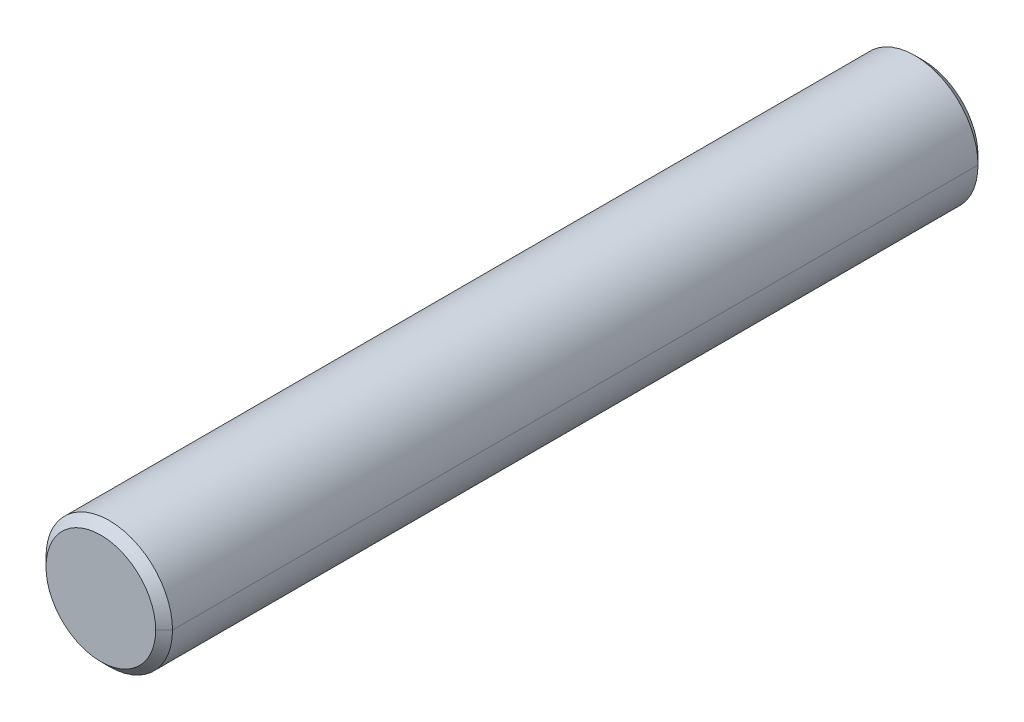
ISO-10303-21;
HEADER;
FILE_DESCRIPTION(('STEP AP214'),'2;1');
FILE_NAME('part.step','',(''),(''),'','','');
FILE_SCHEMA(('AUTOMOTIVE_DESIGN { 1 0 10303 214 1 1 1 1 }'));
ENDSEC;
DATA;
#1=APPLICATION_CONTEXT('core data for automotive mechanical design processes');
#2=APPLICATION_PROTOCOL_DEFINITION('international standard','automotive_design',2000,#1);
#3=PRODUCT_CONTEXT('',#1,'mechanical');
#4=PRODUCT('Part','Part','',(#3));
#5=PRODUCT_RELATED_PRODUCT_CATEGORY('part','',(#4));
#6=PRODUCT_DEFINITION_FORMATION('','',#4);
#7=PRODUCT_DEFINITION_CONTEXT('part definition',#1,'design');
#8=PRODUCT_DEFINITION('design','',#6,#7);
#9=PRODUCT_DEFINITION_SHAPE('','',#8);
#10=(LENGTH_UNIT() NAMED_UNIT(*) SI_UNIT(.MILLI.,.METRE.));
#11=(NAMED_UNIT(*) PLANE_ANGLE_UNIT() SI_UNIT($,.RADIAN.));
#12=(NAMED_UNIT(*) SI_UNIT($,.STERADIAN.) SOLID_ANGLE_UNIT());
#13=UNCERTAINTY_MEASURE_WITH_UNIT(LENGTH_MEASURE(1.E-05),#10,'distance_accuracy_value','');
#14=(GEOMETRIC_REPRESENTATION_CONTEXT(3) GLOBAL_UNCERTAINTY_ASSIGNED_CONTEXT((#13)) GLOBAL_UNIT_ASSIGNED_CONTEXT((#10,
#11,#12)) REPRESENTATION_CONTEXT('',''));
#15=CARTESIAN_POINT('',(0.,0.,0.));
#16=DIRECTION('',(0.,0.,1.));
#17=DIRECTION('',(1.,0.,0.));
#18=AXIS2_PLACEMENT_3D('',#15,#16,#17);
#19=CARTESIAN_POINT('',(0.,0.,-97.5));
#20=DIRECTION('',(0.,0.,1.));
#21=DIRECTION('',(1.,0.,0.));
#22=AXIS2_PLACEMENT_3D('',#19,#20,#21);
#23=PLANE('',#22);
#24=CARTESIAN_POINT('',(0.,0.,-97.5));
#25=DIRECTION('',(0.,0.,-1.));
#26=DIRECTION('',(-1.,0.,0.));
#27=AXIS2_PLACEMENT_3D('',#24,#25,#26);
#28=CIRCLE('',#27,13.);
#29=CARTESIAN_POINT('',(-12.9999999979908,-9.17625102325952E-08,-97.5000000020092));
#30=VERTEX_POINT('',#29);
#31=CARTESIAN_POINT('',(12.9999999979908,9.17625147433775E-08,-97.5000000020092));
#32=VERTEX_POINT('',#31);
#33=EDGE_CURVE('E11',#30,#32,#28,.T.);
#34=ORIENTED_EDGE('',*,*,#33,.T.);
#35=CARTESIAN_POINT('',(0.,0.,-97.5));
#36=DIRECTION('',(0.,0.,-1.));
#37=DIRECTION('',(1.,0.,0.));
#38=AXIS2_PLACEMENT_3D('',#35,#36,#37);
#39=CIRCLE('',#38,13.);
#40=EDGE_CURVE('E26',#32,#30,#39,.T.);
#41=ORIENTED_EDGE('',*,*,#40,.T.);
#42=EDGE_LOOP('',(#34,#41));
#43=FACE_BOUND('',#42,.T.);
#44=ADVANCED_FACE('F16',(#43),#23,.F.);
#45=CARTESIAN_POINT('',(0.,0.,-109.5));
#46=DIRECTION('',(0.,0.,1.));
#47=DIRECTION('',(0.,-1.,0.));
#48=AXIS2_PLACEMENT_3D('',#45,#46,#47);
#49=CONICAL_SURFACE('',#48,1.,0.785398163397448);
#50=DIRECTION('',(-0.707106781186548,-1.49736676786737E-08,0.707106781186548));
#51=VECTOR('',#50,1.);
#52=CARTESIAN_POINT('',(-12.9999999939724,-2.75287530697786E-07,-97.5000000060276));
#53=LINE('',#52,#51);
#54=CARTESIAN_POINT('',(-14.9999999982613,-7.94098632466336E-08,-95.5000000017387));
#55=VERTEX_POINT('',#54);
#56=EDGE_CURVE('E72',#30,#55,#53,.T.);
#57=ORIENTED_EDGE('',*,*,#56,.T.);
#58=CARTESIAN_POINT('',(0.,0.,-95.5));
#59=DIRECTION('',(0.,0.,-1.));
#60=DIRECTION('',(-1.,0.,0.));
#61=AXIS2_PLACEMENT_3D('',#58,#59,#60);
#62=CIRCLE('',#61,15.);
#63=CARTESIAN_POINT('',(14.9999999982613,7.94098646521934E-08,-95.5000000017387));
#64=VERTEX_POINT('',#63);
#65=EDGE_CURVE('E68',#55,#64,#62,.T.);
#66=ORIENTED_EDGE('',*,*,#65,.T.);
#67=DIRECTION('',(0.707106781186548,1.49736642325613E-08,0.707106781186548));
#68=VECTOR('',#67,1.);
#69=CARTESIAN_POINT('',(12.9999999939724,2.75287544230133E-07,-97.5000000060276));
#70=LINE('',#69,#68);
#71=EDGE_CURVE('E60',#32,#64,#70,.T.);
#72=ORIENTED_EDGE('',*,*,#71,.F.);
#73=ORIENTED_EDGE('',*,*,#33,.F.);
#74=EDGE_LOOP('',(#57,#66,#72,#73));
#75=FACE_BOUND('',#74,.T.);
#76=ADVANCED_FACE('F71',(#75),#49,.T.);
#77=CARTESIAN_POINT('',(0.,0.,-109.5));
#78=DIRECTION('',(0.,0.,1.));
#79=DIRECTION('',(0.,-1.,0.));
#80=AXIS2_PLACEMENT_3D('',#77,#78,#79);
#81=CONICAL_SURFACE('',#80,1.,0.785398163397448);
#82=ORIENTED_EDGE('',*,*,#71,.T.);
#83=CARTESIAN_POINT('',(0.,0.,-95.5));
#84=DIRECTION('',(0.,0.,-1.));
#85=DIRECTION('',(1.,0.,0.));
#86=AXIS2_PLACEMENT_3D('',#83,#84,#85);
#87=CIRCLE('',#86,15.);
#88=EDGE_CURVE('E48',#64,#55,#87,.T.);
#89=ORIENTED_EDGE('',*,*,#88,.T.);
#90=ORIENTED_EDGE('',*,*,#56,.F.);
#91=ORIENTED_EDGE('',*,*,#40,.F.);
#92=EDGE_LOOP('',(#82,#89,#90,#91));
#93=FACE_BOUND('',#92,.T.);
#94=ADVANCED_FACE('F64',(#93),#81,.T.);
#95=CARTESIAN_POINT('',(0.,0.,-97.5));
#96=DIRECTION('',(0.,0.,-1.));
#97=DIRECTION('',(1.,0.,0.));
#98=AXIS2_PLACEMENT_3D('',#95,#96,#97);
#99=CYLINDRICAL_SURFACE('',#98,15.);
#100=DIRECTION('',(0.,0.,1.));
#101=VECTOR('',#100,1.);
#102=CARTESIAN_POINT('',(15.,0.,-95.5));
#103=LINE('',#102,#101);
#104=CARTESIAN_POINT('',(14.9999999989523,-7.90509002859594E-08,95.5000000010477));
#105=VERTEX_POINT('',#104);
#106=EDGE_CURVE('E55',#64,#105,#103,.T.);
#107=ORIENTED_EDGE('',*,*,#106,.F.);
#108=ORIENTED_EDGE('',*,*,#65,.F.);
#109=DIRECTION('',(0.,0.,1.));
#110=VECTOR('',#109,1.);
#111=CARTESIAN_POINT('',(-15.,0.,-95.5));
#112=LINE('',#111,#110);
#113=CARTESIAN_POINT('',(-14.9999999989523,7.90509016057015E-08,95.5000000010477));
#114=VERTEX_POINT('',#113);
#115=EDGE_CURVE('E58',#55,#114,#112,.T.);
#116=ORIENTED_EDGE('',*,*,#115,.T.);
#117=CARTESIAN_POINT('',(0.,0.,95.5));
#118=DIRECTION('',(0.,0.,1.));
#119=DIRECTION('',(1.,0.,0.));
#120=AXIS2_PLACEMENT_3D('',#117,#118,#119);
#121=CIRCLE('',#120,15.);
#122=EDGE_CURVE('E19',#105,#114,#121,.T.);
#123=ORIENTED_EDGE('',*,*,#122,.F.);
#124=EDGE_LOOP('',(#107,#108,#116,#123));
#125=FACE_BOUND('',#124,.T.);
#126=ADVANCED_FACE('F77',(#125),#99,.T.);
#127=CARTESIAN_POINT('',(0.,0.,-97.5));
#128=DIRECTION('',(0.,0.,-1.));
#129=DIRECTION('',(1.,0.,0.));
#130=AXIS2_PLACEMENT_3D('',#127,#128,#129);
#131=CYLINDRICAL_SURFACE('',#130,15.);
#132=ORIENTED_EDGE('',*,*,#115,.F.);
#133=ORIENTED_EDGE('',*,*,#88,.F.);
#134=ORIENTED_EDGE('',*,*,#106,.T.);
#135=CARTESIAN_POINT('',(0.,0.,95.5));
#136=DIRECTION('',(0.,0.,1.));
#137=DIRECTION('',(-1.,0.,0.));
#138=AXIS2_PLACEMENT_3D('',#135,#136,#137);
#139=CIRCLE('',#138,15.);
#140=EDGE_CURVE('E98',#114,#105,#139,.T.);
#141=ORIENTED_EDGE('',*,*,#140,.F.);
#142=EDGE_LOOP('',(#132,#133,#134,#141));
#143=FACE_BOUND('',#142,.T.);
#144=ADVANCED_FACE('F53',(#143),#131,.T.);
#145=CARTESIAN_POINT('',(0.,0.,109.5));
#146=DIRECTION('',(0.,0.,-1.));
#147=DIRECTION('',(0.,-1.,0.));
#148=AXIS2_PLACEMENT_3D('',#145,#146,#147);
#149=CONICAL_SURFACE('',#148,1.,0.785398163397448);
#150=DIRECTION('',(0.707106781186546,-1.49059805379341E-08,-0.707106781186549));
#151=VECTOR('',#150,1.);
#152=CARTESIAN_POINT('',(12.9999999963681,-2.74043117807244E-07,97.5000000036319));
#153=LINE('',#152,#151);
#154=CARTESIAN_POINT('',(12.9999999987894,-9.13477059357481E-08,97.5000000012107));
#155=VERTEX_POINT('',#154);
#156=EDGE_CURVE('E80',#155,#105,#153,.T.);
#157=ORIENTED_EDGE('',*,*,#156,.T.);
#158=ORIENTED_EDGE('',*,*,#122,.T.);
#159=DIRECTION('',(-0.707106781186546,1.49059821784402E-08,-0.707106781186549));
#160=VECTOR('',#159,1.);
#161=CARTESIAN_POINT('',(-12.9999999963681,2.74043116609191E-07,97.5000000036319));
#162=LINE('',#161,#160);
#163=CARTESIAN_POINT('',(-12.9999999987894,9.13477055363968E-08,97.5000000012107));
#164=VERTEX_POINT('',#163);
#165=EDGE_CURVE('E100',#164,#114,#162,.T.);
#166=ORIENTED_EDGE('',*,*,#165,.F.);
#167=CARTESIAN_POINT('',(0.,0.,97.5));
#168=DIRECTION('',(0.,0.,1.));
#169=DIRECTION('',(1.,0.,0.));
#170=AXIS2_PLACEMENT_3D('',#167,#168,#169);
#171=CIRCLE('',#170,13.);
#172=EDGE_CURVE('E92',#155,#164,#171,.T.);
#173=ORIENTED_EDGE('',*,*,#172,.F.);
#174=EDGE_LOOP('',(#157,#158,#166,#173));
#175=FACE_BOUND('',#174,.T.);
#176=ADVANCED_FACE('F116',(#175),#149,.T.);
#177=CARTESIAN_POINT('',(0.,0.,109.5));
#178=DIRECTION('',(0.,0.,-1.));
#179=DIRECTION('',(0.,-1.,0.));
#180=AXIS2_PLACEMENT_3D('',#177,#178,#179);
#181=CONICAL_SURFACE('',#180,1.,0.785398163397448);
#182=ORIENTED_EDGE('',*,*,#165,.T.);
#183=ORIENTED_EDGE('',*,*,#140,.T.);
#184=ORIENTED_EDGE('',*,*,#156,.F.);
#185=CARTESIAN_POINT('',(0.,0.,97.5));
#186=DIRECTION('',(0.,0.,1.));
#187=DIRECTION('',(-1.,0.,0.));
#188=AXIS2_PLACEMENT_3D('',#185,#186,#187);
#189=CIRCLE('',#188,13.);
#190=EDGE_CURVE('E89',#164,#155,#189,.T.);
#191=ORIENTED_EDGE('',*,*,#190,.F.);
#192=EDGE_LOOP('',(#182,#183,#184,#191));
#193=FACE_BOUND('',#192,.T.);
#194=ADVANCED_FACE('F111',(#193),#181,.T.);
#195=CARTESIAN_POINT('',(0.,0.,97.5));
#196=DIRECTION('',(0.,0.,1.));
#197=DIRECTION('',(1.,0.,0.));
#198=AXIS2_PLACEMENT_3D('',#195,#196,#197);
#199=PLANE('',#198);
#200=ORIENTED_EDGE('',*,*,#172,.T.);
#201=ORIENTED_EDGE('',*,*,#190,.T.);
#202=EDGE_LOOP('',(#200,#201));
#203=FACE_BOUND('',#202,.T.);
#204=ADVANCED_FACE('F135',(#203),#199,.T.);
#205=CLOSED_SHELL('',(#44,#76,#94,#126,#144,#176,#194,#204));
#206=MANIFOLD_SOLID_BREP('B1',#205);
#207=ADVANCED_BREP_SHAPE_REPRESENTATION('',(#18,#206),#14);
#208=SHAPE_DEFINITION_REPRESENTATION(#9,#207);
ENDSEC;
END-ISO-10303-21;
